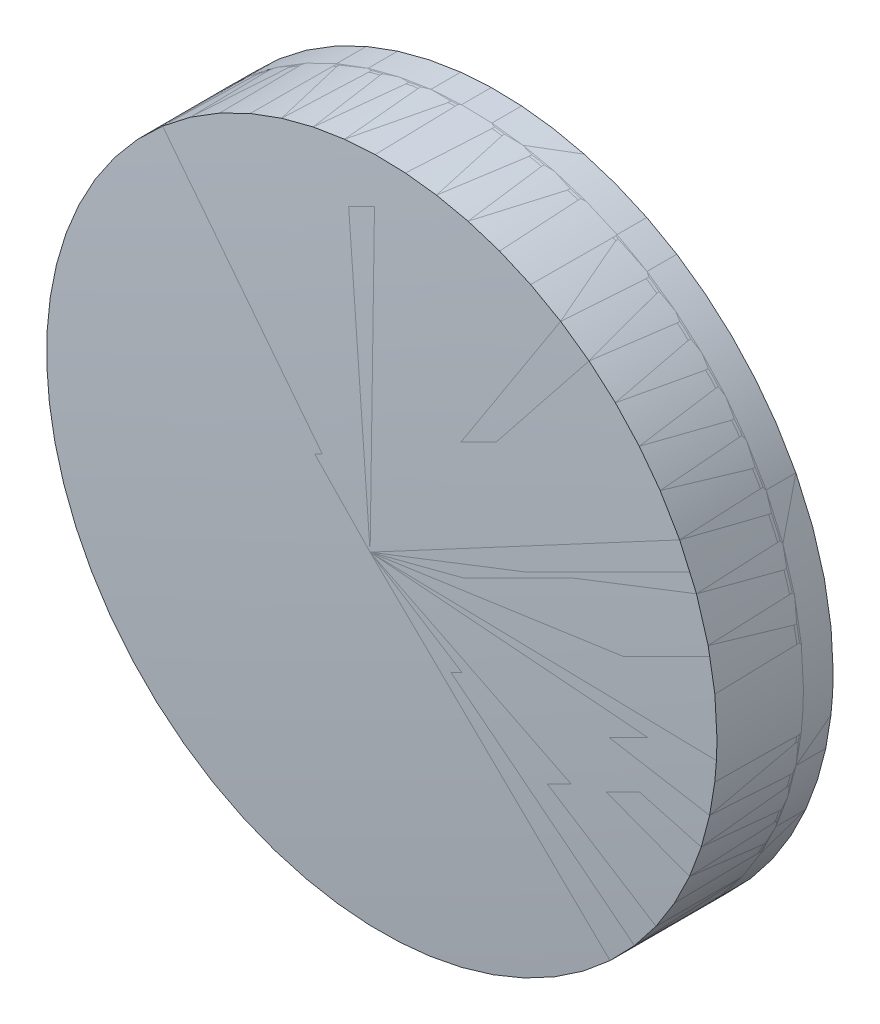
ISO-10303-21;
HEADER;
FILE_DESCRIPTION(('STEP AP214'),'2;1');
FILE_NAME('part.step','',(''),(''),'','','');
FILE_SCHEMA(('AUTOMOTIVE_DESIGN { 1 0 10303 214 1 1 1 1 }'));
ENDSEC;
DATA;
#1=APPLICATION_CONTEXT('core data for automotive mechanical design processes');
#2=APPLICATION_PROTOCOL_DEFINITION('international standard','automotive_design',2000,#1);
#3=PRODUCT_CONTEXT('',#1,'mechanical');
#4=PRODUCT('Part','Part','',(#3));
#5=PRODUCT_RELATED_PRODUCT_CATEGORY('part','',(#4));
#6=PRODUCT_DEFINITION_FORMATION('','',#4);
#7=PRODUCT_DEFINITION_CONTEXT('part definition',#1,'design');
#8=PRODUCT_DEFINITION('design','',#6,#7);
#9=PRODUCT_DEFINITION_SHAPE('','',#8);
#10=(LENGTH_UNIT() NAMED_UNIT(*) SI_UNIT(.MILLI.,.METRE.));
#11=(NAMED_UNIT(*) PLANE_ANGLE_UNIT() SI_UNIT($,.RADIAN.));
#12=(NAMED_UNIT(*) SI_UNIT($,.STERADIAN.) SOLID_ANGLE_UNIT());
#13=UNCERTAINTY_MEASURE_WITH_UNIT(LENGTH_MEASURE(1.E-05),#10,'distance_accuracy_value','');
#14=(GEOMETRIC_REPRESENTATION_CONTEXT(3) GLOBAL_UNCERTAINTY_ASSIGNED_CONTEXT((#13)) GLOBAL_UNIT_ASSIGNED_CONTEXT((#10,
#11,#12)) REPRESENTATION_CONTEXT('',''));
#15=CARTESIAN_POINT('',(0.,0.,0.));
#16=DIRECTION('',(0.,0.,1.));
#17=DIRECTION('',(1.,0.,0.));
#18=AXIS2_PLACEMENT_3D('',#15,#16,#17);
#19=CARTESIAN_POINT('',(-107.2,0.,107.2));
#20=CARTESIAN_POINT('',(-107.2,107.2,107.2));
#21=CARTESIAN_POINT('',(0.,107.2,107.2));
#22=CARTESIAN_POINT('',(107.2,107.2,107.2));
#23=CARTESIAN_POINT('',(107.2,0.,107.2));
#24=CARTESIAN_POINT('',(-107.2,0.,107.2));
#25=CARTESIAN_POINT('',(-107.2,107.2,0.));
#26=CARTESIAN_POINT('',(0.,107.2,0.));
#27=CARTESIAN_POINT('',(107.2,107.2,0.));
#28=CARTESIAN_POINT('',(107.2,0.,107.2));
#29=CARTESIAN_POINT('',(-107.2,0.,107.2));
#30=CARTESIAN_POINT('',(-107.2,0.,0.));
#31=CARTESIAN_POINT('',(0.,0.,0.));
#32=CARTESIAN_POINT('',(107.2,0.,0.));
#33=CARTESIAN_POINT('',(107.2,0.,107.2));
#34=CARTESIAN_POINT('',(-107.2,0.,107.2));
#35=CARTESIAN_POINT('',(-107.2,-107.2,0.));
#36=CARTESIAN_POINT('',(0.,-107.2,0.));
#37=CARTESIAN_POINT('',(107.2,-107.2,0.));
#38=CARTESIAN_POINT('',(107.2,0.,107.2));
#39=CARTESIAN_POINT('',(-107.2,0.,107.2));
#40=CARTESIAN_POINT('',(-107.2,-107.2,107.2));
#41=CARTESIAN_POINT('',(0.,-107.2,107.2));
#42=CARTESIAN_POINT('',(107.2,-107.2,107.2));
#43=CARTESIAN_POINT('',(107.2,0.,107.2));
#44=(BOUNDED_SURFACE() B_SPLINE_SURFACE(2,2,((#19,#20,#21,#22,#23),(#24,#25,#26,#27,#28),(#29,
#30,#31,#32,#33),(#34,#35,#36,#37,#38),(#39,#40,#41,#42,#43)),.UNSPECIFIED.,.F.,.F.,
.F.) B_SPLINE_SURFACE_WITH_KNOTS((3,2,3),(3,2,3),(0.,0.5,1.),(0.,0.5,1.),
.UNSPECIFIED.) GEOMETRIC_REPRESENTATION_ITEM() RATIONAL_B_SPLINE_SURFACE(((1.,0.707106781186548,
1.,0.707106781186548,1.),(0.707106781186548,0.5,0.707106781186548,0.5,0.707106781186548),(1.,
0.707106781186548,1.,0.707106781186548,1.),(0.707106781186548,0.5,0.707106781186548,0.5,
0.707106781186548),(1.,0.707106781186548,1.,0.707106781186548,1.))) REPRESENTATION_ITEM('') SURFACE());
#45=CARTESIAN_POINT('',(12.5,0.,0.731272196949775));
#46=CARTESIAN_POINT('',(12.5,12.5,0.731272196949775));
#47=CARTESIAN_POINT('',(0.,12.5,0.731272196949775));
#48=CARTESIAN_POINT('',(-12.5,12.5,0.731272196949775));
#49=CARTESIAN_POINT('',(-12.5,0.,0.731272196949775));
#50=CARTESIAN_POINT('',(-12.5,-12.5,0.731272196949775));
#51=CARTESIAN_POINT('',(0.,-12.5,0.731272196949775));
#52=CARTESIAN_POINT('',(12.5,-12.5,0.731272196949775));
#53=CARTESIAN_POINT('',(12.5,0.,0.731272196949775));
#54=(BOUNDED_CURVE() B_SPLINE_CURVE(2,(#45,#46,#47,#48,#49,#50,#51,#52,#53),.UNSPECIFIED.,.T.,
.F.) B_SPLINE_CURVE_WITH_KNOTS((3,2,2,2,3),(0.,1.5707963267949,3.14159265358979,
4.71238898038469,6.28318530717959),
.UNSPECIFIED.) CURVE() GEOMETRIC_REPRESENTATION_ITEM() RATIONAL_B_SPLINE_CURVE((1.,
0.707106781186548,1.,0.707106781186548,1.,0.707106781186548,1.,0.707106781186548,1.)) REPRESENTATION_ITEM(''));
#55=CARTESIAN_POINT('',(12.5,0.,0.731272196949775));
#56=VERTEX_POINT('',#55);
#57=EDGE_CURVE('P0_E11',#56,#56,#54,.T.);
#58=ORIENTED_EDGE('',*,*,#57,.F.);
#59=EDGE_LOOP('',(#58));
#60=FACE_BOUND('',#59,.T.);
#61=ADVANCED_FACE('P0_F38',(#60),#44,.F.);
#62=CARTESIAN_POINT('',(12.5,0.,0.731272196949775));
#63=CARTESIAN_POINT('',(12.5,0.,1.83949355516567));
#64=CARTESIAN_POINT('',(12.5,-12.5,0.731272196949775));
#65=CARTESIAN_POINT('',(12.5,-12.5,1.83949355516567));
#66=CARTESIAN_POINT('',(0.,-12.5,0.731272196949775));
#67=CARTESIAN_POINT('',(0.,-12.5,1.83949355516567));
#68=CARTESIAN_POINT('',(-12.5,-12.5,0.731272196949775));
#69=CARTESIAN_POINT('',(-12.5,-12.5,1.83949355516567));
#70=CARTESIAN_POINT('',(-12.5,0.,0.731272196949775));
#71=CARTESIAN_POINT('',(-12.5,0.,1.83949355516567));
#72=CARTESIAN_POINT('',(-12.5,12.5,0.731272196949775));
#73=CARTESIAN_POINT('',(-12.5,12.5,1.83949355516567));
#74=CARTESIAN_POINT('',(0.,12.5,0.731272196949775));
#75=CARTESIAN_POINT('',(0.,12.5,1.83949355516567));
#76=CARTESIAN_POINT('',(12.5,12.5,0.731272196949775));
#77=CARTESIAN_POINT('',(12.5,12.5,1.83949355516567));
#78=CARTESIAN_POINT('',(12.5,0.,0.731272196949775));
#79=CARTESIAN_POINT('',(12.5,0.,1.83949355516567));
#80=(BOUNDED_SURFACE() B_SPLINE_SURFACE(2,1,((#62,#63),(#64,#65),(#66,#67),(#68,#69),(#70,#71),
(#72,#73),(#74,#75),(#76,#77),(#78,#79)),.UNSPECIFIED.,.T.,.F.,
.F.) B_SPLINE_SURFACE_WITH_KNOTS((3,2,2,2,3),(2,2),(0.,0.25,0.5,0.75,1.),(0.,1.),
.UNSPECIFIED.) GEOMETRIC_REPRESENTATION_ITEM() RATIONAL_B_SPLINE_SURFACE(((1.,1.),
(0.707106781186548,0.707106781186548),(1.,1.),(0.707106781186548,0.707106781186548),(1.,1.),
(0.707106781186548,0.707106781186548),(1.,1.),(0.707106781186548,0.707106781186548),(1.,1.))) REPRESENTATION_ITEM('') SURFACE());
#81=CARTESIAN_POINT('',(12.5,0.,0.731272196949775));
#82=CARTESIAN_POINT('',(12.5,0.,1.83949355516567));
#83=(BOUNDED_CURVE() B_SPLINE_CURVE(1,(#81,#82),.UNSPECIFIED.,.F.,
.F.) B_SPLINE_CURVE_WITH_KNOTS((2,2),(0.,1.),
.UNSPECIFIED.) CURVE() GEOMETRIC_REPRESENTATION_ITEM() RATIONAL_B_SPLINE_CURVE((1.,1.)) REPRESENTATION_ITEM(''));
#84=CARTESIAN_POINT('',(12.5,0.,1.83949355516567));
#85=VERTEX_POINT('',#84);
#86=EDGE_CURVE('P0_E43',#56,#85,#83,.T.);
#87=CARTESIAN_POINT('',(12.5,0.,1.83949355516567));
#88=CARTESIAN_POINT('',(12.5,12.5,1.83949355516567));
#89=CARTESIAN_POINT('',(0.,12.5,1.83949355516567));
#90=CARTESIAN_POINT('',(-12.5,12.5,1.83949355516567));
#91=CARTESIAN_POINT('',(-12.5,0.,1.83949355516567));
#92=CARTESIAN_POINT('',(-12.5,-12.5,1.83949355516567));
#93=CARTESIAN_POINT('',(0.,-12.5,1.83949355516567));
#94=CARTESIAN_POINT('',(12.5,-12.5,1.83949355516567));
#95=CARTESIAN_POINT('',(12.5,0.,1.83949355516567));
#96=(BOUNDED_CURVE() B_SPLINE_CURVE(2,(#87,#88,#89,#90,#91,#92,#93,#94,#95),.UNSPECIFIED.,.T.,
.F.) B_SPLINE_CURVE_WITH_KNOTS((3,2,2,2,3),(0.,1.5707963267949,3.14159265358979,
4.71238898038469,6.28318530717959),
.UNSPECIFIED.) CURVE() GEOMETRIC_REPRESENTATION_ITEM() RATIONAL_B_SPLINE_CURVE((1.,
0.707106781186548,1.,0.707106781186548,1.,0.707106781186548,1.,0.707106781186548,1.)) REPRESENTATION_ITEM(''));
#97=EDGE_CURVE('P0_E94',#85,#85,#96,.T.);
#98=ORIENTED_EDGE('',*,*,#86,.T.);
#99=ORIENTED_EDGE('',*,*,#97,.F.);
#100=ORIENTED_EDGE('',*,*,#86,.F.);
#101=ORIENTED_EDGE('',*,*,#57,.T.);
#102=EDGE_LOOP('',(#98,#99,#100,#101));
#103=FACE_BOUND('',#102,.T.);
#104=ADVANCED_FACE('P0_F119',(#103),#80,.F.);
#105=CARTESIAN_POINT('',(12.5,0.,1.83949355516567));
#106=CARTESIAN_POINT('',(12.5,0.,5.06357622688795));
#107=CARTESIAN_POINT('',(12.5,-12.5,1.83949355516567));
#108=CARTESIAN_POINT('',(12.5,-12.5,5.06357622688795));
#109=CARTESIAN_POINT('',(0.,-12.5,1.83949355516567));
#110=CARTESIAN_POINT('',(0.,-12.5,5.06357622688795));
#111=CARTESIAN_POINT('',(-12.5,-12.5,1.83949355516567));
#112=CARTESIAN_POINT('',(-12.5,-12.5,5.06357622688795));
#113=CARTESIAN_POINT('',(-12.5,0.,1.83949355516567));
#114=CARTESIAN_POINT('',(-12.5,0.,5.06357622688795));
#115=CARTESIAN_POINT('',(-12.5,12.5,1.83949355516567));
#116=CARTESIAN_POINT('',(-12.5,12.5,5.06357622688795));
#117=CARTESIAN_POINT('',(0.,12.5,1.83949355516567));
#118=CARTESIAN_POINT('',(0.,12.5,5.06357622688795));
#119=CARTESIAN_POINT('',(12.5,12.5,1.83949355516567));
#120=CARTESIAN_POINT('',(12.5,12.5,5.06357622688795));
#121=CARTESIAN_POINT('',(12.5,0.,1.83949355516567));
#122=CARTESIAN_POINT('',(12.5,0.,5.06357622688795));
#123=(BOUNDED_SURFACE() B_SPLINE_SURFACE(2,1,((#105,#106),(#107,#108),(#109,#110),(#111,#112),
(#113,#114),(#115,#116),(#117,#118),(#119,#120),(#121,#122)),.UNSPECIFIED.,.T.,.F.,
.F.) B_SPLINE_SURFACE_WITH_KNOTS((3,2,2,2,3),(2,2),(0.,0.25,0.5,0.75,1.),(0.,1.),
.UNSPECIFIED.) GEOMETRIC_REPRESENTATION_ITEM() RATIONAL_B_SPLINE_SURFACE(((1.,1.),
(0.707106781186548,0.707106781186548),(1.,1.),(0.707106781186548,0.707106781186548),(1.,1.),
(0.707106781186548,0.707106781186548),(1.,1.),(0.707106781186548,0.707106781186548),(1.,1.))) REPRESENTATION_ITEM('') SURFACE());
#124=CARTESIAN_POINT('',(0.,0.,1.9));
#125=DIRECTION('',(0.,0.,-1.));
#126=DIRECTION('',(-1.,0.,0.));
#127=AXIS2_PLACEMENT_3D('',#124,#125,#126);
#128=CIRCLE('',#127,12.5);
#129=CARTESIAN_POINT('',(12.5,0.,1.9));
#130=VERTEX_POINT('',#129);
#131=EDGE_CURVE('P0_E88',#130,#130,#128,.T.);
#132=CARTESIAN_POINT('',(12.5,0.,1.83949355516567));
#133=CARTESIAN_POINT('',(12.5,0.,5.06357622688794));
#134=(BOUNDED_CURVE() B_SPLINE_CURVE(1,(#132,#133),.UNSPECIFIED.,.F.,
.F.) B_SPLINE_CURVE_WITH_KNOTS((2,2),(0.,1.),
.UNSPECIFIED.) CURVE() GEOMETRIC_REPRESENTATION_ITEM() RATIONAL_B_SPLINE_CURVE((1.,1.)) REPRESENTATION_ITEM(''));
#135=EDGE_CURVE('P0_E74',#85,#130,#134,.T.);
#136=ORIENTED_EDGE('',*,*,#131,.T.);
#137=ORIENTED_EDGE('',*,*,#135,.F.);
#138=ORIENTED_EDGE('',*,*,#97,.T.);
#139=ORIENTED_EDGE('',*,*,#135,.T.);
#140=EDGE_LOOP('',(#136,#137,#138,#139));
#141=FACE_BOUND('',#140,.T.);
#142=ADVANCED_FACE('P0_F121',(#141),#123,.F.);
#143=CARTESIAN_POINT('',(0.,0.,1.9));
#144=DIRECTION('',(0.,0.,1.));
#145=DIRECTION('',(1.,0.,0.));
#146=AXIS2_PLACEMENT_3D('',#143,#144,#145);
#147=CYLINDRICAL_SURFACE('',#146,12.5);
#148=CARTESIAN_POINT('',(0.,0.,2.));
#149=DIRECTION('',(0.,0.,-1.));
#150=DIRECTION('',(-1.,0.,0.));
#151=AXIS2_PLACEMENT_3D('',#148,#149,#150);
#152=CIRCLE('',#151,12.5);
#153=CARTESIAN_POINT('',(12.5,0.,1.99999999999991));
#154=VERTEX_POINT('',#153);
#155=EDGE_CURVE('P0_E72',#154,#154,#152,.T.);
#156=ORIENTED_EDGE('',*,*,#155,.T.);
#157=EDGE_LOOP('',(#156));
#158=FACE_BOUND('',#157,.T.);
#159=ORIENTED_EDGE('',*,*,#131,.F.);
#160=EDGE_LOOP('',(#159));
#161=FACE_BOUND('',#160,.T.);
#162=ADVANCED_FACE('P0_F126',(#158,#161),#147,.T.);
#163=CARTESIAN_POINT('',(179.23,0.,-173.73));
#164=CARTESIAN_POINT('',(179.23,179.23,-173.73));
#165=CARTESIAN_POINT('',(-1.05259631660769E-13,179.23,-173.73));
#166=CARTESIAN_POINT('',(-179.23,179.23,-173.73));
#167=CARTESIAN_POINT('',(-179.23,0.,-173.73));
#168=CARTESIAN_POINT('',(179.23,0.,-173.73));
#169=CARTESIAN_POINT('',(179.23,179.23,5.49999999999982));
#170=CARTESIAN_POINT('',(0.,179.23,5.49999999999996));
#171=CARTESIAN_POINT('',(-179.23,179.23,5.50000000000013));
#172=CARTESIAN_POINT('',(-179.23,0.,-173.73));
#173=CARTESIAN_POINT('',(179.23,0.,-173.73));
#174=CARTESIAN_POINT('',(179.23,2.03461881552327E-13,5.49999999999994));
#175=CARTESIAN_POINT('',(0.,0.,5.5));
#176=CARTESIAN_POINT('',(-179.23,-1.40146097842233E-13,5.50000000000003));
#177=CARTESIAN_POINT('',(-179.23,0.,-173.73));
#178=CARTESIAN_POINT('',(179.23,0.,-173.73));
#179=CARTESIAN_POINT('',(179.23,-179.23,5.50000000000008));
#180=CARTESIAN_POINT('',(1.19936933783158E-13,-179.23,5.49999999999999));
#181=CARTESIAN_POINT('',(-179.23,-179.23,5.5));
#182=CARTESIAN_POINT('',(-179.23,0.,-173.73));
#183=CARTESIAN_POINT('',(179.23,0.,-173.73));
#184=CARTESIAN_POINT('',(179.23,-179.23,-173.73));
#185=CARTESIAN_POINT('',(0.,-179.23,-173.73));
#186=CARTESIAN_POINT('',(-179.23,-179.23,-173.73));
#187=CARTESIAN_POINT('',(-179.23,0.,-173.73));
#188=(BOUNDED_SURFACE() B_SPLINE_SURFACE(2,2,((#163,#164,#165,#166,#167),(#168,#169,#170,#171,
#172),(#173,#174,#175,#176,#177),(#178,#179,#180,#181,#182),(#183,#184,#185,#186,#187)),
.UNSPECIFIED.,.F.,.F.,.F.) B_SPLINE_SURFACE_WITH_KNOTS((3,2,3),(3,2,3),(0.,0.5,1.),(0.,0.5,1.),
.UNSPECIFIED.) GEOMETRIC_REPRESENTATION_ITEM() RATIONAL_B_SPLINE_SURFACE(((1.,0.707106781186548,
1.,0.707106781186548,1.),(0.707106781186548,0.5,0.707106781186548,0.5,0.707106781186548),(1.,
0.707106781186548,1.,0.707106781186548,1.),(0.707106781186548,0.5,0.707106781186548,0.5,
0.707106781186548),(1.,0.707106781186548,1.,0.707106781186548,1.))) REPRESENTATION_ITEM('') SURFACE());
#189=CARTESIAN_POINT('',(12.5,0.,5.06357622688794));
#190=CARTESIAN_POINT('',(12.5,12.5,5.06357622688794));
#191=CARTESIAN_POINT('',(0.,12.5,5.06357622688794));
#192=CARTESIAN_POINT('',(-12.5,12.5,5.06357622688794));
#193=CARTESIAN_POINT('',(-12.5,0.,5.06357622688794));
#194=CARTESIAN_POINT('',(-12.5,-12.5,5.06357622688794));
#195=CARTESIAN_POINT('',(0.,-12.5,5.06357622688794));
#196=CARTESIAN_POINT('',(12.5,-12.5,5.06357622688794));
#197=CARTESIAN_POINT('',(12.5,0.,5.06357622688794));
#198=(BOUNDED_CURVE() B_SPLINE_CURVE(2,(#189,#190,#191,#192,#193,#194,#195,#196,#197),
.UNSPECIFIED.,.T.,.F.) B_SPLINE_CURVE_WITH_KNOTS((3,2,2,2,3),(0.,1.5707963267949,
3.14159265358979,4.71238898038469,6.28318530717959),
.UNSPECIFIED.) CURVE() GEOMETRIC_REPRESENTATION_ITEM() RATIONAL_B_SPLINE_CURVE((1.,
0.707106781186548,1.,0.707106781186548,1.,0.707106781186548,1.,0.707106781186548,1.)) REPRESENTATION_ITEM(''));
#199=CARTESIAN_POINT('',(12.5,0.,5.06357622688794));
#200=VERTEX_POINT('',#199);
#201=EDGE_CURVE('P0_E70',#200,#200,#198,.T.);
#202=ORIENTED_EDGE('',*,*,#201,.T.);
#203=EDGE_LOOP('',(#202));
#204=FACE_BOUND('',#203,.T.);
#205=ADVANCED_FACE('P0_F137',(#204),#188,.F.);
#206=EDGE_CURVE('P0_E57',#154,#200,#134,.T.);
#207=ORIENTED_EDGE('',*,*,#206,.F.);
#208=ORIENTED_EDGE('',*,*,#155,.F.);
#209=ORIENTED_EDGE('',*,*,#206,.T.);
#210=ORIENTED_EDGE('',*,*,#201,.F.);
#211=EDGE_LOOP('',(#207,#208,#209,#210));
#212=FACE_BOUND('',#211,.T.);
#213=ADVANCED_FACE('P0_F68',(#212),#123,.F.);
#214=CLOSED_SHELL('',(#61,#104,#142,#162,#205,#213));
#215=MANIFOLD_SOLID_BREP('P0_B2',#214);
#216=CARTESIAN_POINT('',(-107.2,0.,107.2));
#217=CARTESIAN_POINT('',(-107.2,107.2,107.2));
#218=CARTESIAN_POINT('',(0.,107.2,107.2));
#219=CARTESIAN_POINT('',(107.2,107.2,107.2));
#220=CARTESIAN_POINT('',(107.2,0.,107.2));
#221=CARTESIAN_POINT('',(-107.2,0.,107.2));
#222=CARTESIAN_POINT('',(-107.2,107.2,0.));
#223=CARTESIAN_POINT('',(0.,107.2,0.));
#224=CARTESIAN_POINT('',(107.2,107.2,0.));
#225=CARTESIAN_POINT('',(107.2,0.,107.2));
#226=CARTESIAN_POINT('',(-107.2,0.,107.2));
#227=CARTESIAN_POINT('',(-107.2,0.,0.));
#228=CARTESIAN_POINT('',(0.,0.,0.));
#229=CARTESIAN_POINT('',(107.2,0.,0.));
#230=CARTESIAN_POINT('',(107.2,0.,107.2));
#231=CARTESIAN_POINT('',(-107.2,0.,107.2));
#232=CARTESIAN_POINT('',(-107.2,-107.2,0.));
#233=CARTESIAN_POINT('',(0.,-107.2,0.));
#234=CARTESIAN_POINT('',(107.2,-107.2,0.));
#235=CARTESIAN_POINT('',(107.2,0.,107.2));
#236=CARTESIAN_POINT('',(-107.2,0.,107.2));
#237=CARTESIAN_POINT('',(-107.2,-107.2,107.2));
#238=CARTESIAN_POINT('',(0.,-107.2,107.2));
#239=CARTESIAN_POINT('',(107.2,-107.2,107.2));
#240=CARTESIAN_POINT('',(107.2,0.,107.2));
#241=(BOUNDED_SURFACE() B_SPLINE_SURFACE(2,2,((#216,#217,#218,#219,#220),(#221,#222,#223,#224,
#225),(#226,#227,#228,#229,#230),(#231,#232,#233,#234,#235),(#236,#237,#238,#239,#240)),
.UNSPECIFIED.,.F.,.F.,.F.) B_SPLINE_SURFACE_WITH_KNOTS((3,2,3),(3,2,3),(0.,0.5,1.),(0.,0.5,1.),
.UNSPECIFIED.) GEOMETRIC_REPRESENTATION_ITEM() RATIONAL_B_SPLINE_SURFACE(((1.,0.707106781186548,
1.,0.707106781186548,1.),(0.707106781186548,0.5,0.707106781186548,0.5,0.707106781186548),(1.,
0.707106781186548,1.,0.707106781186548,1.),(0.707106781186548,0.5,0.707106781186548,0.5,
0.707106781186548),(1.,0.707106781186548,1.,0.707106781186548,1.))) REPRESENTATION_ITEM('') SURFACE());
#242=CARTESIAN_POINT('',(12.5,0.,0.731272196949775));
#243=CARTESIAN_POINT('',(12.5,12.5,0.731272196949775));
#244=CARTESIAN_POINT('',(0.,12.5,0.731272196949775));
#245=CARTESIAN_POINT('',(-12.5,12.5,0.731272196949775));
#246=CARTESIAN_POINT('',(-12.5,0.,0.731272196949775));
#247=CARTESIAN_POINT('',(-12.5,-12.5,0.731272196949775));
#248=CARTESIAN_POINT('',(0.,-12.5,0.731272196949775));
#249=CARTESIAN_POINT('',(12.5,-12.5,0.731272196949775));
#250=CARTESIAN_POINT('',(12.5,0.,0.731272196949775));
#251=(BOUNDED_CURVE() B_SPLINE_CURVE(2,(#242,#243,#244,#245,#246,#247,#248,#249,#250),
.UNSPECIFIED.,.T.,.F.) B_SPLINE_CURVE_WITH_KNOTS((3,2,2,2,3),(0.,1.5707963267949,
3.14159265358979,4.71238898038469,6.28318530717959),
.UNSPECIFIED.) CURVE() GEOMETRIC_REPRESENTATION_ITEM() RATIONAL_B_SPLINE_CURVE((1.,
0.707106781186548,1.,0.707106781186548,1.,0.707106781186548,1.,0.707106781186548,1.)) REPRESENTATION_ITEM(''));
#252=CARTESIAN_POINT('',(12.5,0.,0.731272196949775));
#253=VERTEX_POINT('',#252);
#254=EDGE_CURVE('P1_E11',#253,#253,#251,.T.);
#255=ORIENTED_EDGE('',*,*,#254,.F.);
#256=EDGE_LOOP('',(#255));
#257=FACE_BOUND('',#256,.T.);
#258=ADVANCED_FACE('P1_F16',(#257),#241,.F.);
#259=CARTESIAN_POINT('',(67.9,0.,-64.9));
#260=CARTESIAN_POINT('',(67.8999999999998,67.8999999999998,-64.8999999999999));
#261=CARTESIAN_POINT('',(0.,67.9,-64.9));
#262=CARTESIAN_POINT('',(-67.8999999999998,67.8999999999998,-64.8999999999998));
#263=CARTESIAN_POINT('',(-67.9,0.,-64.9));
#264=CARTESIAN_POINT('',(67.8999999999998,0.,-64.8999999999999));
#265=CARTESIAN_POINT('',(67.9,67.9,2.99999999999995));
#266=CARTESIAN_POINT('',(0.,67.8999999999998,3.));
#267=CARTESIAN_POINT('',(-67.9,67.9,3.));
#268=CARTESIAN_POINT('',(-67.8999999999998,0.,-64.8999999999999));
#269=CARTESIAN_POINT('',(67.9,0.,-64.9));
#270=CARTESIAN_POINT('',(67.8999999999998,0.,2.99999999999997));
#271=CARTESIAN_POINT('',(0.,0.,3.));
#272=CARTESIAN_POINT('',(-67.8999999999998,0.,3.));
#273=CARTESIAN_POINT('',(-67.9,0.,-64.9));
#274=CARTESIAN_POINT('',(67.8999999999998,0.,-64.8999999999999));
#275=CARTESIAN_POINT('',(67.9,-67.9,3.));
#276=CARTESIAN_POINT('',(0.,-67.8999999999998,2.99999999999998));
#277=CARTESIAN_POINT('',(-67.9,-67.9,2.99999999999997));
#278=CARTESIAN_POINT('',(-67.8999999999998,0.,-64.8999999999999));
#279=CARTESIAN_POINT('',(67.9,0.,-64.9));
#280=CARTESIAN_POINT('',(67.8999999999998,-67.8999999999998,-64.8999999999999));
#281=CARTESIAN_POINT('',(0.,-67.9,-64.9));
#282=CARTESIAN_POINT('',(-67.8999999999998,-67.8999999999998,-64.8999999999999));
#283=CARTESIAN_POINT('',(-67.9,0.,-64.9));
#284=(BOUNDED_SURFACE() B_SPLINE_SURFACE(2,2,((#259,#260,#261,#262,#263),(#264,#265,#266,#267,
#268),(#269,#270,#271,#272,#273),(#274,#275,#276,#277,#278),(#279,#280,#281,#282,#283)),
.UNSPECIFIED.,.F.,.F.,.F.) B_SPLINE_SURFACE_WITH_KNOTS((3,2,3),(3,2,3),(0.,0.5,1.),(0.,0.5,1.),
.UNSPECIFIED.) GEOMETRIC_REPRESENTATION_ITEM() RATIONAL_B_SPLINE_SURFACE(((1.,0.707106781186548,
1.,0.707106781186548,1.),(0.707106781186548,0.5,0.707106781186548,0.5,0.707106781186548),(1.,
0.707106781186548,1.,0.707106781186548,1.),(0.707106781186548,0.5,0.707106781186548,0.5,
0.707106781186548),(1.,0.707106781186548,1.,0.707106781186548,1.))) REPRESENTATION_ITEM('') SURFACE());
#285=CARTESIAN_POINT('',(12.5,0.,1.83949355516567));
#286=CARTESIAN_POINT('',(12.5,12.5,1.83949355516567));
#287=CARTESIAN_POINT('',(0.,12.5,1.83949355516567));
#288=CARTESIAN_POINT('',(-12.5,12.5,1.83949355516567));
#289=CARTESIAN_POINT('',(-12.5,0.,1.83949355516567));
#290=CARTESIAN_POINT('',(-12.5,-12.5,1.83949355516567));
#291=CARTESIAN_POINT('',(0.,-12.5,1.83949355516567));
#292=CARTESIAN_POINT('',(12.5,-12.5,1.83949355516567));
#293=CARTESIAN_POINT('',(12.5,0.,1.83949355516567));
#294=(BOUNDED_CURVE() B_SPLINE_CURVE(2,(#285,#286,#287,#288,#289,#290,#291,#292,#293),
.UNSPECIFIED.,.T.,.F.) B_SPLINE_CURVE_WITH_KNOTS((3,2,2,2,3),(0.,1.5707963267949,
3.14159265358979,4.71238898038469,6.28318530717959),
.UNSPECIFIED.) CURVE() GEOMETRIC_REPRESENTATION_ITEM() RATIONAL_B_SPLINE_CURVE((1.,
0.707106781186548,1.,0.707106781186548,1.,0.707106781186548,1.,0.707106781186548,1.)) REPRESENTATION_ITEM(''));
#295=CARTESIAN_POINT('',(12.5,0.,1.83949355516567));
#296=VERTEX_POINT('',#295);
#297=EDGE_CURVE('P1_E38',#296,#296,#294,.T.);
#298=ORIENTED_EDGE('',*,*,#297,.T.);
#299=EDGE_LOOP('',(#298));
#300=FACE_BOUND('',#299,.T.);
#301=ADVANCED_FACE('P1_F18',(#300),#284,.F.);
#302=CARTESIAN_POINT('',(12.5,0.,0.731272196949775));
#303=CARTESIAN_POINT('',(12.5,0.,1.83949355516567));
#304=CARTESIAN_POINT('',(12.5,-12.5,0.731272196949775));
#305=CARTESIAN_POINT('',(12.5,-12.5,1.83949355516567));
#306=CARTESIAN_POINT('',(0.,-12.5,0.731272196949775));
#307=CARTESIAN_POINT('',(0.,-12.5,1.83949355516567));
#308=CARTESIAN_POINT('',(-12.5,-12.5,0.731272196949775));
#309=CARTESIAN_POINT('',(-12.5,-12.5,1.83949355516567));
#310=CARTESIAN_POINT('',(-12.5,0.,0.731272196949775));
#311=CARTESIAN_POINT('',(-12.5,0.,1.83949355516567));
#312=CARTESIAN_POINT('',(-12.5,12.5,0.731272196949775));
#313=CARTESIAN_POINT('',(-12.5,12.5,1.83949355516567));
#314=CARTESIAN_POINT('',(0.,12.5,0.731272196949775));
#315=CARTESIAN_POINT('',(0.,12.5,1.83949355516567));
#316=CARTESIAN_POINT('',(12.5,12.5,0.731272196949775));
#317=CARTESIAN_POINT('',(12.5,12.5,1.83949355516567));
#318=CARTESIAN_POINT('',(12.5,0.,0.731272196949775));
#319=CARTESIAN_POINT('',(12.5,0.,1.83949355516567));
#320=(BOUNDED_SURFACE() B_SPLINE_SURFACE(2,1,((#302,#303),(#304,#305),(#306,#307),(#308,#309),
(#310,#311),(#312,#313),(#314,#315),(#316,#317),(#318,#319)),.UNSPECIFIED.,.T.,.F.,
.F.) B_SPLINE_SURFACE_WITH_KNOTS((3,2,2,2,3),(2,2),(0.,0.25,0.5,0.75,1.),(0.,1.),
.UNSPECIFIED.) GEOMETRIC_REPRESENTATION_ITEM() RATIONAL_B_SPLINE_SURFACE(((1.,1.),
(0.707106781186548,0.707106781186548),(1.,1.),(0.707106781186548,0.707106781186548),(1.,1.),
(0.707106781186548,0.707106781186548),(1.,1.),(0.707106781186548,0.707106781186548),(1.,1.))) REPRESENTATION_ITEM('') SURFACE());
#321=CARTESIAN_POINT('',(12.5,0.,0.731272196949775));
#322=CARTESIAN_POINT('',(12.5,0.,1.83949355516567));
#323=(BOUNDED_CURVE() B_SPLINE_CURVE(1,(#321,#322),.UNSPECIFIED.,.F.,
.F.) B_SPLINE_CURVE_WITH_KNOTS((2,2),(0.,1.),
.UNSPECIFIED.) CURVE() GEOMETRIC_REPRESENTATION_ITEM() RATIONAL_B_SPLINE_CURVE((1.,1.)) REPRESENTATION_ITEM(''));
#324=EDGE_CURVE('P1_E22',#253,#296,#323,.T.);
#325=ORIENTED_EDGE('',*,*,#324,.T.);
#326=ORIENTED_EDGE('',*,*,#297,.F.);
#327=ORIENTED_EDGE('',*,*,#324,.F.);
#328=ORIENTED_EDGE('',*,*,#254,.T.);
#329=EDGE_LOOP('',(#325,#326,#327,#328));
#330=FACE_BOUND('',#329,.T.);
#331=ADVANCED_FACE('P1_F39',(#330),#320,.F.);
#332=CLOSED_SHELL('',(#258,#301,#331));
#333=MANIFOLD_SOLID_BREP('P1_B1',#332);
#334=CARTESIAN_POINT('',(67.9,0.,-64.9));
#335=CARTESIAN_POINT('',(67.8999999999998,-67.8999999999998,-64.8999999999999));
#336=CARTESIAN_POINT('',(0.,-67.9,-64.9));
#337=CARTESIAN_POINT('',(-67.8999999999998,-67.8999999999998,-64.8999999999998));
#338=CARTESIAN_POINT('',(-67.9,0.,-64.9));
#339=CARTESIAN_POINT('',(67.8999999999998,0.,-64.8999999999999));
#340=CARTESIAN_POINT('',(67.9,-67.9,3.));
#341=CARTESIAN_POINT('',(0.,-67.8999999999998,3.00000000000001));
#342=CARTESIAN_POINT('',(-67.9,-67.9,3.));
#343=CARTESIAN_POINT('',(-67.8999999999998,0.,-64.8999999999999));
#344=CARTESIAN_POINT('',(67.9,0.,-64.9));
#345=CARTESIAN_POINT('',(67.8999999999998,0.,2.99999999999997));
#346=CARTESIAN_POINT('',(0.,0.,3.));
#347=CARTESIAN_POINT('',(-67.8999999999998,0.,3.));
#348=CARTESIAN_POINT('',(-67.9,0.,-64.9));
#349=CARTESIAN_POINT('',(67.8999999999998,0.,-64.8999999999999));
#350=CARTESIAN_POINT('',(67.9,67.9,2.99999999999997));
#351=CARTESIAN_POINT('',(0.,67.8999999999998,2.99999999999997));
#352=CARTESIAN_POINT('',(-67.9,67.9,2.99999999999997));
#353=CARTESIAN_POINT('',(-67.8999999999998,0.,-64.8999999999999));
#354=CARTESIAN_POINT('',(67.9,0.,-64.9));
#355=CARTESIAN_POINT('',(67.8999999999998,67.8999999999998,-64.8999999999999));
#356=CARTESIAN_POINT('',(0.,67.9,-64.9));
#357=CARTESIAN_POINT('',(-67.8999999999998,67.8999999999998,-64.8999999999999));
#358=CARTESIAN_POINT('',(-67.9,0.,-64.9));
#359=(BOUNDED_SURFACE() B_SPLINE_SURFACE(2,2,((#334,#335,#336,#337,#338),(#339,#340,#341,#342,
#343),(#344,#345,#346,#347,#348),(#349,#350,#351,#352,#353),(#354,#355,#356,#357,#358)),
.UNSPECIFIED.,.F.,.F.,.F.) B_SPLINE_SURFACE_WITH_KNOTS((3,2,3),(3,2,3),(0.,0.5,1.),(0.,0.5,1.),
.UNSPECIFIED.) GEOMETRIC_REPRESENTATION_ITEM() RATIONAL_B_SPLINE_SURFACE(((1.,0.707106781186548,
1.,0.707106781186548,1.),(0.707106781186548,0.5,0.707106781186548,0.5,0.707106781186548),(1.,
0.707106781186548,1.,0.707106781186548,1.),(0.707106781186548,0.5,0.707106781186548,0.5,
0.707106781186548),(1.,0.707106781186548,1.,0.707106781186548,1.))) REPRESENTATION_ITEM('') SURFACE());
#360=CARTESIAN_POINT('',(12.5,0.,1.83949355516567));
#361=CARTESIAN_POINT('',(12.5,12.5,1.83949355516567));
#362=CARTESIAN_POINT('',(0.,12.5,1.83949355516567));
#363=CARTESIAN_POINT('',(-12.5,12.5,1.83949355516567));
#364=CARTESIAN_POINT('',(-12.5,0.,1.83949355516567));
#365=CARTESIAN_POINT('',(-12.5,-12.5,1.83949355516567));
#366=CARTESIAN_POINT('',(0.,-12.5,1.83949355516567));
#367=CARTESIAN_POINT('',(12.5,-12.5,1.83949355516567));
#368=CARTESIAN_POINT('',(12.5,0.,1.83949355516567));
#369=(BOUNDED_CURVE() B_SPLINE_CURVE(2,(#360,#361,#362,#363,#364,#365,#366,#367,#368),
.UNSPECIFIED.,.T.,.F.) B_SPLINE_CURVE_WITH_KNOTS((3,2,2,2,3),(0.,1.5707963267949,
3.14159265358979,4.71238898038469,6.28318530717959),
.UNSPECIFIED.) CURVE() GEOMETRIC_REPRESENTATION_ITEM() RATIONAL_B_SPLINE_CURVE((1.,
0.707106781186548,1.,0.707106781186548,1.,0.707106781186548,1.,0.707106781186548,1.)) REPRESENTATION_ITEM(''));
#370=CARTESIAN_POINT('',(12.5,0.,1.83949355516567));
#371=VERTEX_POINT('',#370);
#372=EDGE_CURVE('P2_E11',#371,#371,#369,.T.);
#373=ORIENTED_EDGE('',*,*,#372,.F.);
#374=EDGE_LOOP('',(#373));
#375=FACE_BOUND('',#374,.T.);
#376=ADVANCED_FACE('P2_F16',(#375),#359,.F.);
#377=CARTESIAN_POINT('',(179.23,0.,-173.73));
#378=CARTESIAN_POINT('',(179.23,179.23,-173.73));
#379=CARTESIAN_POINT('',(-1.05259631660769E-13,179.23,-173.73));
#380=CARTESIAN_POINT('',(-179.23,179.23,-173.73));
#381=CARTESIAN_POINT('',(-179.23,0.,-173.73));
#382=CARTESIAN_POINT('',(179.23,0.,-173.73));
#383=CARTESIAN_POINT('',(179.23,179.23,5.49999999999982));
#384=CARTESIAN_POINT('',(0.,179.23,5.49999999999996));
#385=CARTESIAN_POINT('',(-179.23,179.23,5.50000000000013));
#386=CARTESIAN_POINT('',(-179.23,0.,-173.73));
#387=CARTESIAN_POINT('',(179.23,0.,-173.73));
#388=CARTESIAN_POINT('',(179.23,2.03461881552327E-13,5.49999999999994));
#389=CARTESIAN_POINT('',(0.,0.,5.5));
#390=CARTESIAN_POINT('',(-179.23,-1.40146097842233E-13,5.50000000000003));
#391=CARTESIAN_POINT('',(-179.23,0.,-173.73));
#392=CARTESIAN_POINT('',(179.23,0.,-173.73));
#393=CARTESIAN_POINT('',(179.23,-179.23,5.50000000000008));
#394=CARTESIAN_POINT('',(1.19936933783158E-13,-179.23,5.49999999999999));
#395=CARTESIAN_POINT('',(-179.23,-179.23,5.5));
#396=CARTESIAN_POINT('',(-179.23,0.,-173.73));
#397=CARTESIAN_POINT('',(179.23,0.,-173.73));
#398=CARTESIAN_POINT('',(179.23,-179.23,-173.73));
#399=CARTESIAN_POINT('',(0.,-179.23,-173.73));
#400=CARTESIAN_POINT('',(-179.23,-179.23,-173.73));
#401=CARTESIAN_POINT('',(-179.23,0.,-173.73));
#402=(BOUNDED_SURFACE() B_SPLINE_SURFACE(2,2,((#377,#378,#379,#380,#381),(#382,#383,#384,#385,
#386),(#387,#388,#389,#390,#391),(#392,#393,#394,#395,#396),(#397,#398,#399,#400,#401)),
.UNSPECIFIED.,.F.,.F.,.F.) B_SPLINE_SURFACE_WITH_KNOTS((3,2,3),(3,2,3),(0.,0.5,1.),(0.,0.5,1.),
.UNSPECIFIED.) GEOMETRIC_REPRESENTATION_ITEM() RATIONAL_B_SPLINE_SURFACE(((1.,0.707106781186548,
1.,0.707106781186548,1.),(0.707106781186548,0.5,0.707106781186548,0.5,0.707106781186548),(1.,
0.707106781186548,1.,0.707106781186548,1.),(0.707106781186548,0.5,0.707106781186548,0.5,
0.707106781186548),(1.,0.707106781186548,1.,0.707106781186548,1.))) REPRESENTATION_ITEM('') SURFACE());
#403=CARTESIAN_POINT('',(12.5,0.,5.06357622688794));
#404=CARTESIAN_POINT('',(12.5,12.5,5.06357622688794));
#405=CARTESIAN_POINT('',(0.,12.5,5.06357622688794));
#406=CARTESIAN_POINT('',(-12.5,12.5,5.06357622688794));
#407=CARTESIAN_POINT('',(-12.5,0.,5.06357622688794));
#408=CARTESIAN_POINT('',(-12.5,-12.5,5.06357622688794));
#409=CARTESIAN_POINT('',(0.,-12.5,5.06357622688794));
#410=CARTESIAN_POINT('',(12.5,-12.5,5.06357622688794));
#411=CARTESIAN_POINT('',(12.5,0.,5.06357622688794));
#412=(BOUNDED_CURVE() B_SPLINE_CURVE(2,(#403,#404,#405,#406,#407,#408,#409,#410,#411),
.UNSPECIFIED.,.T.,.F.) B_SPLINE_CURVE_WITH_KNOTS((3,2,2,2,3),(0.,1.5707963267949,
3.14159265358979,4.71238898038469,6.28318530717959),
.UNSPECIFIED.) CURVE() GEOMETRIC_REPRESENTATION_ITEM() RATIONAL_B_SPLINE_CURVE((1.,
0.707106781186548,1.,0.707106781186548,1.,0.707106781186548,1.,0.707106781186548,1.)) REPRESENTATION_ITEM(''));
#413=CARTESIAN_POINT('',(12.5,0.,5.06357622688794));
#414=VERTEX_POINT('',#413);
#415=EDGE_CURVE('P2_E38',#414,#414,#412,.T.);
#416=ORIENTED_EDGE('',*,*,#415,.T.);
#417=EDGE_LOOP('',(#416));
#418=FACE_BOUND('',#417,.T.);
#419=ADVANCED_FACE('P2_F72',(#418),#402,.F.);
#420=CARTESIAN_POINT('',(12.5,0.,1.83949355516567));
#421=CARTESIAN_POINT('',(12.5,0.,5.06357622688795));
#422=CARTESIAN_POINT('',(12.5,-12.5,1.83949355516567));
#423=CARTESIAN_POINT('',(12.5,-12.5,5.06357622688795));
#424=CARTESIAN_POINT('',(0.,-12.5,1.83949355516567));
#425=CARTESIAN_POINT('',(0.,-12.5,5.06357622688795));
#426=CARTESIAN_POINT('',(-12.5,-12.5,1.83949355516567));
#427=CARTESIAN_POINT('',(-12.5,-12.5,5.06357622688795));
#428=CARTESIAN_POINT('',(-12.5,0.,1.83949355516567));
#429=CARTESIAN_POINT('',(-12.5,0.,5.06357622688795));
#430=CARTESIAN_POINT('',(-12.5,12.5,1.83949355516567));
#431=CARTESIAN_POINT('',(-12.5,12.5,5.06357622688795));
#432=CARTESIAN_POINT('',(0.,12.5,1.83949355516567));
#433=CARTESIAN_POINT('',(0.,12.5,5.06357622688795));
#434=CARTESIAN_POINT('',(12.5,12.5,1.83949355516567));
#435=CARTESIAN_POINT('',(12.5,12.5,5.06357622688795));
#436=CARTESIAN_POINT('',(12.5,0.,1.83949355516567));
#437=CARTESIAN_POINT('',(12.5,0.,5.06357622688795));
#438=(BOUNDED_SURFACE() B_SPLINE_SURFACE(2,1,((#420,#421),(#422,#423),(#424,#425),(#426,#427),
(#428,#429),(#430,#431),(#432,#433),(#434,#435),(#436,#437)),.UNSPECIFIED.,.T.,.F.,
.F.) B_SPLINE_SURFACE_WITH_KNOTS((3,2,2,2,3),(2,2),(0.,0.25,0.5,0.75,1.),(0.,1.),
.UNSPECIFIED.) GEOMETRIC_REPRESENTATION_ITEM() RATIONAL_B_SPLINE_SURFACE(((1.,1.),
(0.707106781186548,0.707106781186548),(1.,1.),(0.707106781186548,0.707106781186548),(1.,1.),
(0.707106781186548,0.707106781186548),(1.,1.),(0.707106781186548,0.707106781186548),(1.,1.))) REPRESENTATION_ITEM('') SURFACE());
#439=CARTESIAN_POINT('',(12.5,0.,1.83949355516567));
#440=CARTESIAN_POINT('',(12.5,0.,5.06357622688794));
#441=(BOUNDED_CURVE() B_SPLINE_CURVE(1,(#439,#440),.UNSPECIFIED.,.F.,
.F.) B_SPLINE_CURVE_WITH_KNOTS((2,2),(0.,1.),
.UNSPECIFIED.) CURVE() GEOMETRIC_REPRESENTATION_ITEM() RATIONAL_B_SPLINE_CURVE((1.,1.)) REPRESENTATION_ITEM(''));
#442=EDGE_CURVE('P2_E29',#371,#414,#441,.T.);
#443=ORIENTED_EDGE('',*,*,#442,.T.);
#444=ORIENTED_EDGE('',*,*,#415,.F.);
#445=ORIENTED_EDGE('',*,*,#442,.F.);
#446=ORIENTED_EDGE('',*,*,#372,.T.);
#447=EDGE_LOOP('',(#443,#444,#445,#446));
#448=FACE_BOUND('',#447,.T.);
#449=ADVANCED_FACE('P2_F18',(#448),#438,.F.);
#450=CLOSED_SHELL('',(#376,#419,#449));
#451=MANIFOLD_SOLID_BREP('P2_B1',#450);
#452=ADVANCED_BREP_SHAPE_REPRESENTATION('',(#18,#215,#333,#451),#14);
#453=SHAPE_DEFINITION_REPRESENTATION(#9,#452);
ENDSEC;
END-ISO-10303-21;
